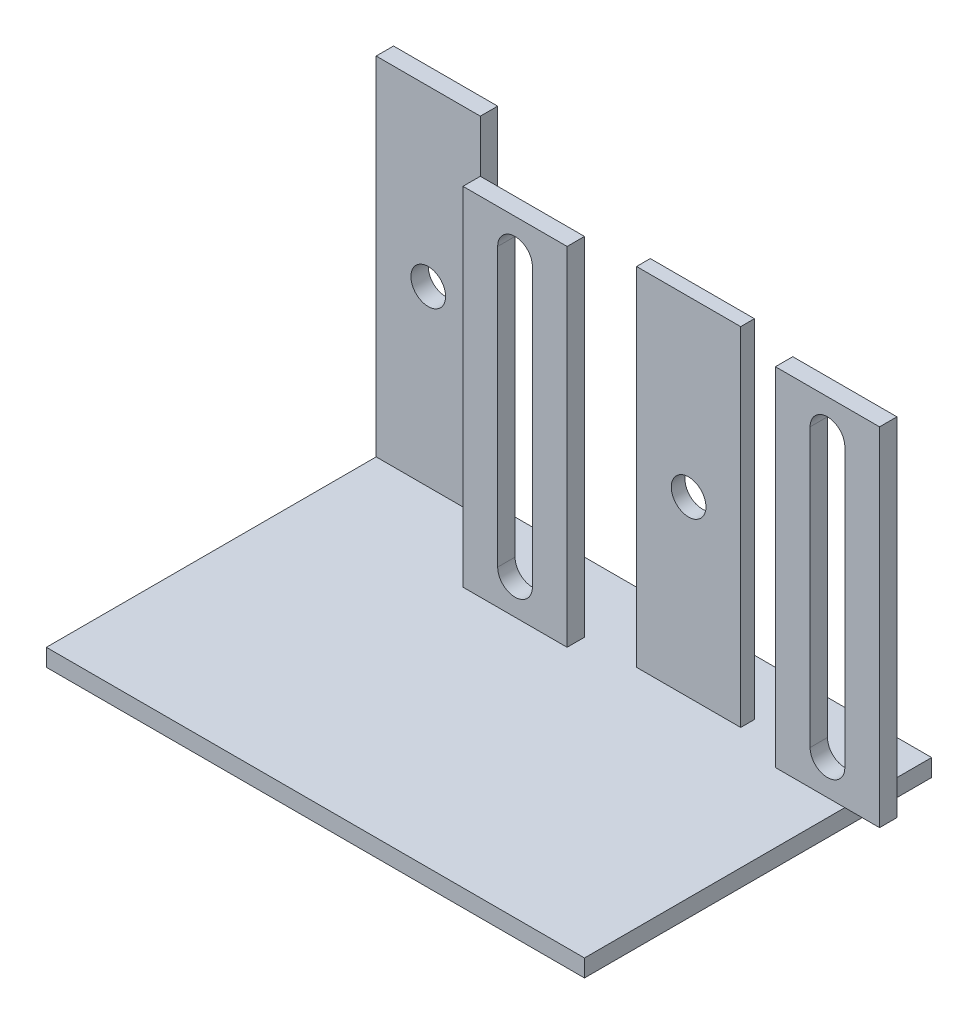
ISO-10303-21;
HEADER;
FILE_DESCRIPTION(('STEP AP214'),'2;1');
FILE_NAME('part.step','',(''),(''),'','','');
FILE_SCHEMA(('AUTOMOTIVE_DESIGN { 1 0 10303 214 1 1 1 1 }'));
ENDSEC;
DATA;
#1=APPLICATION_CONTEXT('core data for automotive mechanical design processes');
#2=APPLICATION_PROTOCOL_DEFINITION('international standard','automotive_design',2000,#1);
#3=PRODUCT_CONTEXT('',#1,'mechanical');
#4=PRODUCT('Part','Part','',(#3));
#5=PRODUCT_RELATED_PRODUCT_CATEGORY('part','',(#4));
#6=PRODUCT_DEFINITION_FORMATION('','',#4);
#7=PRODUCT_DEFINITION_CONTEXT('part definition',#1,'design');
#8=PRODUCT_DEFINITION('design','',#6,#7);
#9=PRODUCT_DEFINITION_SHAPE('','',#8);
#10=(LENGTH_UNIT() NAMED_UNIT(*) SI_UNIT(.MILLI.,.METRE.));
#11=(NAMED_UNIT(*) PLANE_ANGLE_UNIT() SI_UNIT($,.RADIAN.));
#12=(NAMED_UNIT(*) SI_UNIT($,.STERADIAN.) SOLID_ANGLE_UNIT());
#13=UNCERTAINTY_MEASURE_WITH_UNIT(LENGTH_MEASURE(1.E-05),#10,'distance_accuracy_value','');
#14=(GEOMETRIC_REPRESENTATION_CONTEXT(3) GLOBAL_UNCERTAINTY_ASSIGNED_CONTEXT((#13)) GLOBAL_UNIT_ASSIGNED_CONTEXT((#10,
#11,#12)) REPRESENTATION_CONTEXT('',''));
#15=CARTESIAN_POINT('',(0.,0.,0.));
#16=DIRECTION('',(0.,0.,1.));
#17=DIRECTION('',(1.,0.,0.));
#18=AXIS2_PLACEMENT_3D('',#15,#16,#17);
#19=CARTESIAN_POINT('',(0.,10.,0.));
#20=DIRECTION('',(0.,-1.,0.));
#21=DIRECTION('',(0.,0.,-1.));
#22=AXIS2_PLACEMENT_3D('',#19,#20,#21);
#23=PLANE('',#22);
#24=DIRECTION('',(1.,0.,0.));
#25=VECTOR('',#24,1.);
#26=CARTESIAN_POINT('',(270.,10.,-150.));
#27=LINE('',#26,#25);
#28=CARTESIAN_POINT('',(270.,10.,-150.));
#29=VERTEX_POINT('',#28);
#30=CARTESIAN_POINT('',(310.,10.,-150.));
#31=VERTEX_POINT('',#30);
#32=EDGE_CURVE('E371',#29,#31,#27,.T.);
#33=ORIENTED_EDGE('',*,*,#32,.F.);
#34=DIRECTION('',(0.,0.,1.));
#35=VECTOR('',#34,1.);
#36=CARTESIAN_POINT('',(270.,10.,-160.));
#37=LINE('',#36,#35);
#38=CARTESIAN_POINT('',(270.,10.,-160.));
#39=VERTEX_POINT('',#38);
#40=EDGE_CURVE('E375',#39,#29,#37,.T.);
#41=ORIENTED_EDGE('',*,*,#40,.F.);
#42=DIRECTION('',(-1.,0.,0.));
#43=VECTOR('',#42,1.);
#44=CARTESIAN_POINT('',(270.,10.,-160.));
#45=LINE('',#44,#43);
#46=CARTESIAN_POINT('',(310.,10.,-160.));
#47=VERTEX_POINT('',#46);
#48=EDGE_CURVE('E367',#47,#39,#45,.T.);
#49=ORIENTED_EDGE('',*,*,#48,.F.);
#50=DIRECTION('',(0.,0.,-1.));
#51=VECTOR('',#50,1.);
#52=CARTESIAN_POINT('',(310.,10.,0.));
#53=LINE('',#52,#51);
#54=CARTESIAN_POINT('',(310.,10.,-200.));
#55=VERTEX_POINT('',#54);
#56=EDGE_CURVE('E478',#47,#55,#53,.T.);
#57=ORIENTED_EDGE('',*,*,#56,.T.);
#58=DIRECTION('',(-1.,0.,0.));
#59=VECTOR('',#58,1.);
#60=CARTESIAN_POINT('',(0.,10.,-200.));
#61=LINE('',#60,#59);
#62=CARTESIAN_POINT('',(60.,10.,-200.));
#63=VERTEX_POINT('',#62);
#64=EDGE_CURVE('E483',#55,#63,#61,.T.);
#65=ORIENTED_EDGE('',*,*,#64,.T.);
#66=DIRECTION('',(0.,0.,-1.));
#67=VECTOR('',#66,1.);
#68=CARTESIAN_POINT('',(60.,10.,-200.));
#69=LINE('',#68,#67);
#70=CARTESIAN_POINT('',(60.,10.,-190.));
#71=VERTEX_POINT('',#70);
#72=EDGE_CURVE('E442',#71,#63,#69,.T.);
#73=ORIENTED_EDGE('',*,*,#72,.F.);
#74=DIRECTION('',(1.,0.,0.));
#75=VECTOR('',#74,1.);
#76=CARTESIAN_POINT('',(0.,10.,-190.));
#77=LINE('',#76,#75);
#78=CARTESIAN_POINT('',(0.,10.,-190.));
#79=VERTEX_POINT('',#78);
#80=EDGE_CURVE('E425',#79,#71,#77,.T.);
#81=ORIENTED_EDGE('',*,*,#80,.F.);
#82=DIRECTION('',(0.,0.,1.));
#83=VECTOR('',#82,1.);
#84=CARTESIAN_POINT('',(0.,10.,0.));
#85=LINE('',#84,#83);
#86=CARTESIAN_POINT('',(0.,10.,0.));
#87=VERTEX_POINT('',#86);
#88=EDGE_CURVE('E471',#79,#87,#85,.T.);
#89=ORIENTED_EDGE('',*,*,#88,.T.);
#90=DIRECTION('',(1.,0.,0.));
#91=VECTOR('',#90,1.);
#92=CARTESIAN_POINT('',(0.,10.,0.));
#93=LINE('',#92,#91);
#94=CARTESIAN_POINT('',(310.,10.,0.));
#95=VERTEX_POINT('',#94);
#96=EDGE_CURVE('E474',#87,#95,#93,.T.);
#97=ORIENTED_EDGE('',*,*,#96,.T.);
#98=EDGE_CURVE('E479',#95,#31,#53,.T.);
#99=ORIENTED_EDGE('',*,*,#98,.T.);
#100=EDGE_LOOP('',(#33,#41,#49,#57,#65,#73,#81,#89,#97,#99));
#101=FACE_BOUND('',#100,.T.);
#102=DIRECTION('',(0.,0.,1.));
#103=VECTOR('',#102,1.);
#104=CARTESIAN_POINT('',(90.,10.,-160.));
#105=LINE('',#104,#103);
#106=CARTESIAN_POINT('',(90.,10.,-160.));
#107=VERTEX_POINT('',#106);
#108=CARTESIAN_POINT('',(90.,10.,-150.));
#109=VERTEX_POINT('',#108);
#110=EDGE_CURVE('E421',#107,#109,#105,.T.);
#111=ORIENTED_EDGE('',*,*,#110,.F.);
#112=DIRECTION('',(-1.,0.,0.));
#113=VECTOR('',#112,1.);
#114=CARTESIAN_POINT('',(90.,10.,-160.));
#115=LINE('',#114,#113);
#116=CARTESIAN_POINT('',(150.,10.,-160.));
#117=VERTEX_POINT('',#116);
#118=EDGE_CURVE('E408',#117,#107,#115,.T.);
#119=ORIENTED_EDGE('',*,*,#118,.F.);
#120=DIRECTION('',(0.,0.,-1.));
#121=VECTOR('',#120,1.);
#122=CARTESIAN_POINT('',(150.,10.,-160.));
#123=LINE('',#122,#121);
#124=CARTESIAN_POINT('',(150.,10.,-150.));
#125=VERTEX_POINT('',#124);
#126=EDGE_CURVE('E412',#125,#117,#123,.T.);
#127=ORIENTED_EDGE('',*,*,#126,.F.);
#128=DIRECTION('',(1.,0.,0.));
#129=VECTOR('',#128,1.);
#130=CARTESIAN_POINT('',(90.,10.,-150.));
#131=LINE('',#130,#129);
#132=EDGE_CURVE('E417',#109,#125,#131,.T.);
#133=ORIENTED_EDGE('',*,*,#132,.F.);
#134=EDGE_LOOP('',(#111,#119,#127,#133));
#135=FACE_BOUND('',#134,.T.);
#136=DIRECTION('',(0.,0.,1.));
#137=VECTOR('',#136,1.);
#138=CARTESIAN_POINT('',(180.,10.,-160.));
#139=LINE('',#138,#137);
#140=CARTESIAN_POINT('',(180.,10.,-167.912912389238));
#141=VERTEX_POINT('',#140);
#142=CARTESIAN_POINT('',(180.,10.,-160.));
#143=VERTEX_POINT('',#142);
#144=EDGE_CURVE('E330',#141,#143,#139,.T.);
#145=ORIENTED_EDGE('',*,*,#144,.F.);
#146=DIRECTION('',(-1.,0.,0.));
#147=VECTOR('',#146,1.);
#148=CARTESIAN_POINT('',(180.,10.,-167.912912389238));
#149=LINE('',#148,#147);
#150=CARTESIAN_POINT('',(240.,10.,-167.912912389238));
#151=VERTEX_POINT('',#150);
#152=EDGE_CURVE('E317',#151,#141,#149,.T.);
#153=ORIENTED_EDGE('',*,*,#152,.F.);
#154=DIRECTION('',(0.,0.,-1.));
#155=VECTOR('',#154,1.);
#156=CARTESIAN_POINT('',(240.,10.,-160.));
#157=LINE('',#156,#155);
#158=CARTESIAN_POINT('',(240.,10.,-160.));
#159=VERTEX_POINT('',#158);
#160=EDGE_CURVE('E321',#159,#151,#157,.T.);
#161=ORIENTED_EDGE('',*,*,#160,.F.);
#162=DIRECTION('',(1.,0.,0.));
#163=VECTOR('',#162,1.);
#164=CARTESIAN_POINT('',(180.,10.,-160.));
#165=LINE('',#164,#163);
#166=EDGE_CURVE('E326',#143,#159,#165,.T.);
#167=ORIENTED_EDGE('',*,*,#166,.F.);
#168=EDGE_LOOP('',(#145,#153,#161,#167));
#169=FACE_BOUND('',#168,.T.);
#170=ADVANCED_FACE('F45',(#101,#135,#169),#23,.F.);
#171=CARTESIAN_POINT('',(0.,10.,0.));
#172=DIRECTION('',(1.,0.,0.));
#173=DIRECTION('',(0.,0.,-1.));
#174=AXIS2_PLACEMENT_3D('',#171,#172,#173);
#175=PLANE('',#174);
#176=DIRECTION('',(0.,0.,1.));
#177=VECTOR('',#176,1.);
#178=CARTESIAN_POINT('',(0.,0.,0.));
#179=LINE('',#178,#177);
#180=CARTESIAN_POINT('',(0.,0.,-200.));
#181=VERTEX_POINT('',#180);
#182=CARTESIAN_POINT('',(0.,0.,0.));
#183=VERTEX_POINT('',#182);
#184=EDGE_CURVE('E470',#181,#183,#179,.T.);
#185=ORIENTED_EDGE('',*,*,#184,.T.);
#186=DIRECTION('',(0.,-1.,0.));
#187=VECTOR('',#186,1.);
#188=CARTESIAN_POINT('',(0.,10.,0.));
#189=LINE('',#188,#187);
#190=EDGE_CURVE('E510',#87,#183,#189,.T.);
#191=ORIENTED_EDGE('',*,*,#190,.F.);
#192=ORIENTED_EDGE('',*,*,#88,.F.);
#193=DIRECTION('',(0.,-1.,0.));
#194=VECTOR('',#193,1.);
#195=CARTESIAN_POINT('',(0.,210.,-190.));
#196=LINE('',#195,#194);
#197=CARTESIAN_POINT('',(0.,210.,-190.));
#198=VERTEX_POINT('',#197);
#199=EDGE_CURVE('E466',#198,#79,#196,.T.);
#200=ORIENTED_EDGE('',*,*,#199,.F.);
#201=DIRECTION('',(0.,0.,1.));
#202=VECTOR('',#201,1.);
#203=CARTESIAN_POINT('',(0.,210.,-200.));
#204=LINE('',#203,#202);
#205=CARTESIAN_POINT('',(0.,210.,-200.));
#206=VERTEX_POINT('',#205);
#207=EDGE_CURVE('E437',#206,#198,#204,.T.);
#208=ORIENTED_EDGE('',*,*,#207,.F.);
#209=DIRECTION('',(0.,-1.,0.));
#210=VECTOR('',#209,1.);
#211=CARTESIAN_POINT('',(0.,10.,-200.));
#212=LINE('',#211,#210);
#213=EDGE_CURVE('E487',#206,#181,#212,.T.);
#214=ORIENTED_EDGE('',*,*,#213,.T.);
#215=EDGE_LOOP('',(#185,#191,#192,#200,#208,#214));
#216=FACE_BOUND('',#215,.T.);
#217=ADVANCED_FACE('F47',(#216),#175,.F.);
#218=CARTESIAN_POINT('',(0.,10.,0.));
#219=DIRECTION('',(0.,0.,-1.));
#220=DIRECTION('',(-1.,0.,0.));
#221=AXIS2_PLACEMENT_3D('',#218,#219,#220);
#222=PLANE('',#221);
#223=DIRECTION('',(1.,0.,0.));
#224=VECTOR('',#223,1.);
#225=CARTESIAN_POINT('',(0.,0.,0.));
#226=LINE('',#225,#224);
#227=CARTESIAN_POINT('',(310.,0.,0.));
#228=VERTEX_POINT('',#227);
#229=EDGE_CURVE('E491',#183,#228,#226,.T.);
#230=ORIENTED_EDGE('',*,*,#229,.T.);
#231=DIRECTION('',(0.,-1.,0.));
#232=VECTOR('',#231,1.);
#233=CARTESIAN_POINT('',(310.,10.,0.));
#234=LINE('',#233,#232);
#235=EDGE_CURVE('E506',#95,#228,#234,.T.);
#236=ORIENTED_EDGE('',*,*,#235,.F.);
#237=ORIENTED_EDGE('',*,*,#96,.F.);
#238=ORIENTED_EDGE('',*,*,#190,.T.);
#239=EDGE_LOOP('',(#230,#236,#237,#238));
#240=FACE_BOUND('',#239,.T.);
#241=ADVANCED_FACE('F569',(#240),#222,.F.);
#242=CARTESIAN_POINT('',(310.,10.,0.));
#243=DIRECTION('',(-1.,0.,0.));
#244=DIRECTION('',(0.,0.,1.));
#245=AXIS2_PLACEMENT_3D('',#242,#243,#244);
#246=PLANE('',#245);
#247=DIRECTION('',(0.,0.,-1.));
#248=VECTOR('',#247,1.);
#249=CARTESIAN_POINT('',(310.,0.,0.));
#250=LINE('',#249,#248);
#251=CARTESIAN_POINT('',(310.,0.,-200.));
#252=VERTEX_POINT('',#251);
#253=EDGE_CURVE('E494',#228,#252,#250,.T.);
#254=ORIENTED_EDGE('',*,*,#253,.T.);
#255=DIRECTION('',(0.,-1.,0.));
#256=VECTOR('',#255,1.);
#257=CARTESIAN_POINT('',(310.,10.,-200.));
#258=LINE('',#257,#256);
#259=EDGE_CURVE('E502',#55,#252,#258,.T.);
#260=ORIENTED_EDGE('',*,*,#259,.F.);
#261=ORIENTED_EDGE('',*,*,#56,.F.);
#262=EDGE_CURVE('E484',#31,#47,#53,.T.);
#263=ORIENTED_EDGE('',*,*,#262,.F.);
#264=ORIENTED_EDGE('',*,*,#98,.F.);
#265=ORIENTED_EDGE('',*,*,#235,.T.);
#266=EDGE_LOOP('',(#254,#260,#261,#263,#264,#265));
#267=FACE_BOUND('',#266,.T.);
#268=ADVANCED_FACE('F583',(#267),#246,.F.);
#269=CARTESIAN_POINT('',(0.,10.,-200.));
#270=DIRECTION('',(0.,0.,1.));
#271=DIRECTION('',(1.,0.,0.));
#272=AXIS2_PLACEMENT_3D('',#269,#270,#271);
#273=PLANE('',#272);
#274=CARTESIAN_POINT('',(30.,110.,-200.));
#275=DIRECTION('',(0.,0.,1.));
#276=DIRECTION('',(1.,0.,0.));
#277=AXIS2_PLACEMENT_3D('',#274,#275,#276);
#278=CIRCLE('',#277,10.);
#279=CARTESIAN_POINT('',(40.,110.,-200.));
#280=VERTEX_POINT('',#279);
#281=EDGE_CURVE('E296',#280,#280,#278,.T.);
#282=ORIENTED_EDGE('',*,*,#281,.T.);
#283=EDGE_LOOP('',(#282));
#284=FACE_BOUND('',#283,.T.);
#285=DIRECTION('',(-1.,0.,0.));
#286=VECTOR('',#285,1.);
#287=CARTESIAN_POINT('',(0.,0.,-200.));
#288=LINE('',#287,#286);
#289=EDGE_CURVE('E475',#252,#181,#288,.T.);
#290=ORIENTED_EDGE('',*,*,#289,.T.);
#291=ORIENTED_EDGE('',*,*,#213,.F.);
#292=DIRECTION('',(-1.,0.,0.));
#293=VECTOR('',#292,1.);
#294=CARTESIAN_POINT('',(0.,210.,-200.));
#295=LINE('',#294,#293);
#296=CARTESIAN_POINT('',(60.,210.,-200.));
#297=VERTEX_POINT('',#296);
#298=EDGE_CURVE('E448',#297,#206,#295,.T.);
#299=ORIENTED_EDGE('',*,*,#298,.F.);
#300=DIRECTION('',(0.,-1.,0.));
#301=VECTOR('',#300,1.);
#302=CARTESIAN_POINT('',(60.,210.,-200.));
#303=LINE('',#302,#301);
#304=EDGE_CURVE('E452',#297,#63,#303,.T.);
#305=ORIENTED_EDGE('',*,*,#304,.T.);
#306=ORIENTED_EDGE('',*,*,#64,.F.);
#307=ORIENTED_EDGE('',*,*,#259,.T.);
#308=EDGE_LOOP('',(#290,#291,#299,#305,#306,#307));
#309=FACE_BOUND('',#308,.T.);
#310=ADVANCED_FACE('F579',(#284,#309),#273,.F.);
#311=CARTESIAN_POINT('',(0.,0.,0.));
#312=DIRECTION('',(0.,-1.,0.));
#313=DIRECTION('',(0.,0.,-1.));
#314=AXIS2_PLACEMENT_3D('',#311,#312,#313);
#315=PLANE('',#314);
#316=ORIENTED_EDGE('',*,*,#184,.F.);
#317=ORIENTED_EDGE('',*,*,#289,.F.);
#318=ORIENTED_EDGE('',*,*,#253,.F.);
#319=ORIENTED_EDGE('',*,*,#229,.F.);
#320=EDGE_LOOP('',(#316,#317,#318,#319));
#321=FACE_BOUND('',#320,.T.);
#322=ADVANCED_FACE('F576',(#321),#315,.T.);
#323=CARTESIAN_POINT('',(0.,210.,-190.));
#324=DIRECTION('',(0.,0.,-1.));
#325=DIRECTION('',(-1.,0.,0.));
#326=AXIS2_PLACEMENT_3D('',#323,#324,#325);
#327=PLANE('',#326);
#328=CARTESIAN_POINT('',(30.,110.,-190.));
#329=DIRECTION('',(0.,0.,-1.));
#330=DIRECTION('',(-1.,0.,0.));
#331=AXIS2_PLACEMENT_3D('',#328,#329,#330);
#332=CIRCLE('',#331,10.);
#333=CARTESIAN_POINT('',(20.,110.,-190.));
#334=VERTEX_POINT('',#333);
#335=EDGE_CURVE('E49',#334,#334,#332,.T.);
#336=ORIENTED_EDGE('',*,*,#335,.T.);
#337=EDGE_LOOP('',(#336));
#338=FACE_BOUND('',#337,.T.);
#339=ORIENTED_EDGE('',*,*,#80,.T.);
#340=DIRECTION('',(0.,-1.,0.));
#341=VECTOR('',#340,1.);
#342=CARTESIAN_POINT('',(60.,210.,-190.));
#343=LINE('',#342,#341);
#344=CARTESIAN_POINT('',(60.,210.,-190.));
#345=VERTEX_POINT('',#344);
#346=EDGE_CURVE('E462',#345,#71,#343,.T.);
#347=ORIENTED_EDGE('',*,*,#346,.F.);
#348=DIRECTION('',(1.,0.,0.));
#349=VECTOR('',#348,1.);
#350=CARTESIAN_POINT('',(0.,210.,-190.));
#351=LINE('',#350,#349);
#352=EDGE_CURVE('E441',#198,#345,#351,.T.);
#353=ORIENTED_EDGE('',*,*,#352,.F.);
#354=ORIENTED_EDGE('',*,*,#199,.T.);
#355=EDGE_LOOP('',(#339,#347,#353,#354));
#356=FACE_BOUND('',#355,.T.);
#357=ADVANCED_FACE('F574',(#338,#356),#327,.F.);
#358=CARTESIAN_POINT('',(60.,210.,-200.));
#359=DIRECTION('',(-1.,0.,0.));
#360=DIRECTION('',(0.,0.,1.));
#361=AXIS2_PLACEMENT_3D('',#358,#359,#360);
#362=PLANE('',#361);
#363=ORIENTED_EDGE('',*,*,#72,.T.);
#364=ORIENTED_EDGE('',*,*,#304,.F.);
#365=DIRECTION('',(0.,0.,-1.));
#366=VECTOR('',#365,1.);
#367=CARTESIAN_POINT('',(60.,210.,-200.));
#368=LINE('',#367,#366);
#369=EDGE_CURVE('E445',#345,#297,#368,.T.);
#370=ORIENTED_EDGE('',*,*,#369,.F.);
#371=ORIENTED_EDGE('',*,*,#346,.T.);
#372=EDGE_LOOP('',(#363,#364,#370,#371));
#373=FACE_BOUND('',#372,.T.);
#374=ADVANCED_FACE('F611',(#373),#362,.F.);
#375=CARTESIAN_POINT('',(0.,210.,0.));
#376=DIRECTION('',(0.,1.,0.));
#377=DIRECTION('',(0.,0.,1.));
#378=AXIS2_PLACEMENT_3D('',#375,#376,#377);
#379=PLANE('',#378);
#380=ORIENTED_EDGE('',*,*,#207,.T.);
#381=ORIENTED_EDGE('',*,*,#352,.T.);
#382=ORIENTED_EDGE('',*,*,#369,.T.);
#383=ORIENTED_EDGE('',*,*,#298,.T.);
#384=EDGE_LOOP('',(#380,#381,#382,#383));
#385=FACE_BOUND('',#384,.T.);
#386=ADVANCED_FACE('F606',(#385),#379,.T.);
#387=CARTESIAN_POINT('',(90.,210.,-160.));
#388=DIRECTION('',(1.,0.,0.));
#389=DIRECTION('',(0.,0.,-1.));
#390=AXIS2_PLACEMENT_3D('',#387,#388,#389);
#391=PLANE('',#390);
#392=ORIENTED_EDGE('',*,*,#110,.T.);
#393=DIRECTION('',(0.,-1.,0.));
#394=VECTOR('',#393,1.);
#395=CARTESIAN_POINT('',(90.,210.,-150.));
#396=LINE('',#395,#394);
#397=CARTESIAN_POINT('',(90.,210.,-150.));
#398=VERTEX_POINT('',#397);
#399=EDGE_CURVE('E379',#398,#109,#396,.T.);
#400=ORIENTED_EDGE('',*,*,#399,.F.);
#401=DIRECTION('',(0.,0.,1.));
#402=VECTOR('',#401,1.);
#403=CARTESIAN_POINT('',(90.,210.,-160.));
#404=LINE('',#403,#402);
#405=CARTESIAN_POINT('',(90.,210.,-160.));
#406=VERTEX_POINT('',#405);
#407=EDGE_CURVE('E413',#406,#398,#404,.T.);
#408=ORIENTED_EDGE('',*,*,#407,.F.);
#409=DIRECTION('',(0.,-1.,0.));
#410=VECTOR('',#409,1.);
#411=CARTESIAN_POINT('',(90.,210.,-160.));
#412=LINE('',#411,#410);
#413=EDGE_CURVE('E403',#406,#107,#412,.T.);
#414=ORIENTED_EDGE('',*,*,#413,.T.);
#415=EDGE_LOOP('',(#392,#400,#408,#414));
#416=FACE_BOUND('',#415,.T.);
#417=ADVANCED_FACE('F664',(#416),#391,.F.);
#418=CARTESIAN_POINT('',(90.,210.,-150.));
#419=DIRECTION('',(0.,0.,-1.));
#420=DIRECTION('',(-1.,0.,0.));
#421=AXIS2_PLACEMENT_3D('',#418,#419,#420);
#422=PLANE('',#421);
#423=DIRECTION('',(0.,-1.,0.));
#424=VECTOR('',#423,1.);
#425=CARTESIAN_POINT('',(110.,190.,-150.));
#426=LINE('',#425,#424);
#427=CARTESIAN_POINT('',(110.,190.,-150.));
#428=VERTEX_POINT('',#427);
#429=CARTESIAN_POINT('',(110.,30.,-150.));
#430=VERTEX_POINT('',#429);
#431=EDGE_CURVE('E254',#428,#430,#426,.T.);
#432=ORIENTED_EDGE('',*,*,#431,.F.);
#433=CARTESIAN_POINT('',(120.,190.,-150.));
#434=DIRECTION('',(0.,0.,1.));
#435=DIRECTION('',(1.,0.,0.));
#436=AXIS2_PLACEMENT_3D('',#433,#434,#435);
#437=CIRCLE('',#436,10.);
#438=CARTESIAN_POINT('',(130.,190.,-150.));
#439=VERTEX_POINT('',#438);
#440=EDGE_CURVE('E62',#439,#428,#437,.T.);
#441=ORIENTED_EDGE('',*,*,#440,.F.);
#442=DIRECTION('',(0.,1.,0.));
#443=VECTOR('',#442,1.);
#444=CARTESIAN_POINT('',(130.,30.,-150.));
#445=LINE('',#444,#443);
#446=CARTESIAN_POINT('',(130.,30.,-150.));
#447=VERTEX_POINT('',#446);
#448=EDGE_CURVE('E241',#447,#439,#445,.T.);
#449=ORIENTED_EDGE('',*,*,#448,.F.);
#450=CARTESIAN_POINT('',(120.,30.,-150.));
#451=DIRECTION('',(0.,0.,1.));
#452=DIRECTION('',(1.,0.,0.));
#453=AXIS2_PLACEMENT_3D('',#450,#451,#452);
#454=CIRCLE('',#453,10.);
#455=EDGE_CURVE('E248',#430,#447,#454,.T.);
#456=ORIENTED_EDGE('',*,*,#455,.F.);
#457=EDGE_LOOP('',(#432,#441,#449,#456));
#458=FACE_BOUND('',#457,.T.);
#459=ORIENTED_EDGE('',*,*,#132,.T.);
#460=DIRECTION('',(0.,-1.,0.));
#461=VECTOR('',#460,1.);
#462=CARTESIAN_POINT('',(150.,210.,-150.));
#463=LINE('',#462,#461);
#464=CARTESIAN_POINT('',(150.,210.,-150.));
#465=VERTEX_POINT('',#464);
#466=EDGE_CURVE('E395',#465,#125,#463,.T.);
#467=ORIENTED_EDGE('',*,*,#466,.F.);
#468=DIRECTION('',(1.,0.,0.));
#469=VECTOR('',#468,1.);
#470=CARTESIAN_POINT('',(90.,210.,-150.));
#471=LINE('',#470,#469);
#472=EDGE_CURVE('E431',#398,#465,#471,.T.);
#473=ORIENTED_EDGE('',*,*,#472,.F.);
#474=ORIENTED_EDGE('',*,*,#399,.T.);
#475=EDGE_LOOP('',(#459,#467,#473,#474));
#476=FACE_BOUND('',#475,.T.);
#477=ADVANCED_FACE('F252',(#458,#476),#422,.F.);
#478=CARTESIAN_POINT('',(150.,210.,-160.));
#479=DIRECTION('',(-1.,0.,0.));
#480=DIRECTION('',(0.,0.,1.));
#481=AXIS2_PLACEMENT_3D('',#478,#479,#480);
#482=PLANE('',#481);
#483=ORIENTED_EDGE('',*,*,#126,.T.);
#484=DIRECTION('',(0.,-1.,0.));
#485=VECTOR('',#484,1.);
#486=CARTESIAN_POINT('',(150.,210.,-160.));
#487=LINE('',#486,#485);
#488=CARTESIAN_POINT('',(150.,210.,-160.));
#489=VERTEX_POINT('',#488);
#490=EDGE_CURVE('E399',#489,#117,#487,.T.);
#491=ORIENTED_EDGE('',*,*,#490,.F.);
#492=DIRECTION('',(0.,0.,-1.));
#493=VECTOR('',#492,1.);
#494=CARTESIAN_POINT('',(150.,210.,-160.));
#495=LINE('',#494,#493);
#496=EDGE_CURVE('E428',#465,#489,#495,.T.);
#497=ORIENTED_EDGE('',*,*,#496,.F.);
#498=ORIENTED_EDGE('',*,*,#466,.T.);
#499=EDGE_LOOP('',(#483,#491,#497,#498));
#500=FACE_BOUND('',#499,.T.);
#501=ADVANCED_FACE('F670',(#500),#482,.F.);
#502=CARTESIAN_POINT('',(90.,210.,-160.));
#503=DIRECTION('',(0.,0.,1.));
#504=DIRECTION('',(1.,0.,0.));
#505=AXIS2_PLACEMENT_3D('',#502,#503,#504);
#506=PLANE('',#505);
#507=DIRECTION('',(0.,1.,0.));
#508=VECTOR('',#507,1.);
#509=CARTESIAN_POINT('',(130.,210.,-160.));
#510=LINE('',#509,#508);
#511=CARTESIAN_POINT('',(130.,30.,-160.));
#512=VERTEX_POINT('',#511);
#513=CARTESIAN_POINT('',(130.,190.,-160.));
#514=VERTEX_POINT('',#513);
#515=EDGE_CURVE('E55',#512,#514,#510,.T.);
#516=ORIENTED_EDGE('',*,*,#515,.T.);
#517=CARTESIAN_POINT('',(120.,190.,-160.));
#518=DIRECTION('',(0.,0.,1.));
#519=DIRECTION('',(1.,0.,0.));
#520=AXIS2_PLACEMENT_3D('',#517,#518,#519);
#521=CIRCLE('',#520,10.);
#522=CARTESIAN_POINT('',(110.,190.,-160.));
#523=VERTEX_POINT('',#522);
#524=EDGE_CURVE('E11',#514,#523,#521,.T.);
#525=ORIENTED_EDGE('',*,*,#524,.T.);
#526=DIRECTION('',(0.,-1.,0.));
#527=VECTOR('',#526,1.);
#528=CARTESIAN_POINT('',(110.,210.,-160.));
#529=LINE('',#528,#527);
#530=CARTESIAN_POINT('',(110.,30.,-160.));
#531=VERTEX_POINT('',#530);
#532=EDGE_CURVE('E530',#523,#531,#529,.T.);
#533=ORIENTED_EDGE('',*,*,#532,.T.);
#534=CARTESIAN_POINT('',(120.,30.,-160.));
#535=DIRECTION('',(0.,0.,1.));
#536=DIRECTION('',(1.,0.,0.));
#537=AXIS2_PLACEMENT_3D('',#534,#535,#536);
#538=CIRCLE('',#537,10.);
#539=EDGE_CURVE('E534',#531,#512,#538,.T.);
#540=ORIENTED_EDGE('',*,*,#539,.T.);
#541=EDGE_LOOP('',(#516,#525,#533,#540));
#542=FACE_BOUND('',#541,.T.);
#543=ORIENTED_EDGE('',*,*,#118,.T.);
#544=ORIENTED_EDGE('',*,*,#413,.F.);
#545=DIRECTION('',(-1.,0.,0.));
#546=VECTOR('',#545,1.);
#547=CARTESIAN_POINT('',(90.,210.,-160.));
#548=LINE('',#547,#546);
#549=EDGE_CURVE('E407',#489,#406,#548,.T.);
#550=ORIENTED_EDGE('',*,*,#549,.F.);
#551=ORIENTED_EDGE('',*,*,#490,.T.);
#552=EDGE_LOOP('',(#543,#544,#550,#551));
#553=FACE_BOUND('',#552,.T.);
#554=ADVANCED_FACE('F540',(#542,#553),#506,.F.);
#555=CARTESIAN_POINT('',(0.,210.,0.));
#556=DIRECTION('',(0.,1.,0.));
#557=DIRECTION('',(0.,0.,1.));
#558=AXIS2_PLACEMENT_3D('',#555,#556,#557);
#559=PLANE('',#558);
#560=ORIENTED_EDGE('',*,*,#407,.T.);
#561=ORIENTED_EDGE('',*,*,#472,.T.);
#562=ORIENTED_EDGE('',*,*,#496,.T.);
#563=ORIENTED_EDGE('',*,*,#549,.T.);
#564=EDGE_LOOP('',(#560,#561,#562,#563));
#565=FACE_BOUND('',#564,.T.);
#566=ADVANCED_FACE('F676',(#565),#559,.T.);
#567=CARTESIAN_POINT('',(0.,10.,0.));
#568=DIRECTION('',(0.,1.,0.));
#569=DIRECTION('',(0.,0.,1.));
#570=AXIS2_PLACEMENT_3D('',#567,#568,#569);
#571=PLANE('',#570);
#572=CARTESIAN_POINT('',(330.,10.,-150.));
#573=VERTEX_POINT('',#572);
#574=EDGE_CURVE('E370',#31,#573,#27,.T.);
#575=ORIENTED_EDGE('',*,*,#574,.F.);
#576=ORIENTED_EDGE('',*,*,#262,.T.);
#577=CARTESIAN_POINT('',(330.,10.,-160.));
#578=VERTEX_POINT('',#577);
#579=EDGE_CURVE('E362',#578,#47,#45,.T.);
#580=ORIENTED_EDGE('',*,*,#579,.F.);
#581=DIRECTION('',(0.,0.,-1.));
#582=VECTOR('',#581,1.);
#583=CARTESIAN_POINT('',(330.,10.,-160.));
#584=LINE('',#583,#582);
#585=EDGE_CURVE('E366',#573,#578,#584,.T.);
#586=ORIENTED_EDGE('',*,*,#585,.F.);
#587=EDGE_LOOP('',(#575,#576,#580,#586));
#588=FACE_BOUND('',#587,.T.);
#589=ADVANCED_FACE('F630',(#588),#571,.F.);
#590=CARTESIAN_POINT('',(270.,210.,-160.));
#591=DIRECTION('',(1.,0.,0.));
#592=DIRECTION('',(0.,0.,-1.));
#593=AXIS2_PLACEMENT_3D('',#590,#591,#592);
#594=PLANE('',#593);
#595=ORIENTED_EDGE('',*,*,#40,.T.);
#596=DIRECTION('',(0.,-1.,0.));
#597=VECTOR('',#596,1.);
#598=CARTESIAN_POINT('',(270.,210.,-150.));
#599=LINE('',#598,#597);
#600=CARTESIAN_POINT('',(270.,210.,-150.));
#601=VERTEX_POINT('',#600);
#602=EDGE_CURVE('E334',#601,#29,#599,.T.);
#603=ORIENTED_EDGE('',*,*,#602,.F.);
#604=DIRECTION('',(0.,0.,1.));
#605=VECTOR('',#604,1.);
#606=CARTESIAN_POINT('',(270.,210.,-160.));
#607=LINE('',#606,#605);
#608=CARTESIAN_POINT('',(270.,210.,-160.));
#609=VERTEX_POINT('',#608);
#610=EDGE_CURVE('E388',#609,#601,#607,.T.);
#611=ORIENTED_EDGE('',*,*,#610,.F.);
#612=DIRECTION('',(0.,-1.,0.));
#613=VECTOR('',#612,1.);
#614=CARTESIAN_POINT('',(270.,210.,-160.));
#615=LINE('',#614,#613);
#616=EDGE_CURVE('E357',#609,#39,#615,.T.);
#617=ORIENTED_EDGE('',*,*,#616,.T.);
#618=EDGE_LOOP('',(#595,#603,#611,#617));
#619=FACE_BOUND('',#618,.T.);
#620=ADVANCED_FACE('F646',(#619),#594,.F.);
#621=CARTESIAN_POINT('',(270.,210.,-150.));
#622=DIRECTION('',(0.,0.,-1.));
#623=DIRECTION('',(-1.,0.,0.));
#624=AXIS2_PLACEMENT_3D('',#621,#622,#623);
#625=PLANE('',#624);
#626=DIRECTION('',(0.,-1.,0.));
#627=VECTOR('',#626,1.);
#628=CARTESIAN_POINT('',(290.,190.,-150.));
#629=LINE('',#628,#627);
#630=CARTESIAN_POINT('',(290.,190.,-150.));
#631=VERTEX_POINT('',#630);
#632=CARTESIAN_POINT('',(290.,30.,-150.));
#633=VERTEX_POINT('',#632);
#634=EDGE_CURVE('E287',#631,#633,#629,.T.);
#635=ORIENTED_EDGE('',*,*,#634,.F.);
#636=CARTESIAN_POINT('',(300.,190.,-150.));
#637=DIRECTION('',(0.,0.,1.));
#638=DIRECTION('',(1.,0.,0.));
#639=AXIS2_PLACEMENT_3D('',#636,#637,#638);
#640=CIRCLE('',#639,10.);
#641=CARTESIAN_POINT('',(310.,190.,-150.));
#642=VERTEX_POINT('',#641);
#643=EDGE_CURVE('E238',#642,#631,#640,.T.);
#644=ORIENTED_EDGE('',*,*,#643,.F.);
#645=DIRECTION('',(0.,1.,0.));
#646=VECTOR('',#645,1.);
#647=CARTESIAN_POINT('',(310.,30.,-150.));
#648=LINE('',#647,#646);
#649=CARTESIAN_POINT('',(310.,30.,-150.));
#650=VERTEX_POINT('',#649);
#651=EDGE_CURVE('E270',#650,#642,#648,.T.);
#652=ORIENTED_EDGE('',*,*,#651,.F.);
#653=CARTESIAN_POINT('',(300.,30.,-150.));
#654=DIRECTION('',(0.,0.,1.));
#655=DIRECTION('',(1.,0.,0.));
#656=AXIS2_PLACEMENT_3D('',#653,#654,#655);
#657=CIRCLE('',#656,10.);
#658=EDGE_CURVE('E283',#633,#650,#657,.T.);
#659=ORIENTED_EDGE('',*,*,#658,.F.);
#660=EDGE_LOOP('',(#635,#644,#652,#659));
#661=FACE_BOUND('',#660,.T.);
#662=ORIENTED_EDGE('',*,*,#32,.T.);
#663=ORIENTED_EDGE('',*,*,#574,.T.);
#664=DIRECTION('',(0.,-1.,0.));
#665=VECTOR('',#664,1.);
#666=CARTESIAN_POINT('',(330.,210.,-150.));
#667=LINE('',#666,#665);
#668=CARTESIAN_POINT('',(330.,210.,-150.));
#669=VERTEX_POINT('',#668);
#670=EDGE_CURVE('E349',#669,#573,#667,.T.);
#671=ORIENTED_EDGE('',*,*,#670,.F.);
#672=DIRECTION('',(1.,0.,0.));
#673=VECTOR('',#672,1.);
#674=CARTESIAN_POINT('',(270.,210.,-150.));
#675=LINE('',#674,#673);
#676=EDGE_CURVE('E385',#601,#669,#675,.T.);
#677=ORIENTED_EDGE('',*,*,#676,.F.);
#678=ORIENTED_EDGE('',*,*,#602,.T.);
#679=EDGE_LOOP('',(#662,#663,#671,#677,#678));
#680=FACE_BOUND('',#679,.T.);
#681=ADVANCED_FACE('F643',(#661,#680),#625,.F.);
#682=CARTESIAN_POINT('',(330.,210.,-160.));
#683=DIRECTION('',(-1.,0.,0.));
#684=DIRECTION('',(0.,0.,1.));
#685=AXIS2_PLACEMENT_3D('',#682,#683,#684);
#686=PLANE('',#685);
#687=ORIENTED_EDGE('',*,*,#585,.T.);
#688=DIRECTION('',(0.,-1.,0.));
#689=VECTOR('',#688,1.);
#690=CARTESIAN_POINT('',(330.,210.,-160.));
#691=LINE('',#690,#689);
#692=CARTESIAN_POINT('',(330.,210.,-160.));
#693=VERTEX_POINT('',#692);
#694=EDGE_CURVE('E353',#693,#578,#691,.T.);
#695=ORIENTED_EDGE('',*,*,#694,.F.);
#696=DIRECTION('',(0.,0.,-1.));
#697=VECTOR('',#696,1.);
#698=CARTESIAN_POINT('',(330.,210.,-160.));
#699=LINE('',#698,#697);
#700=EDGE_CURVE('E382',#669,#693,#699,.T.);
#701=ORIENTED_EDGE('',*,*,#700,.F.);
#702=ORIENTED_EDGE('',*,*,#670,.T.);
#703=EDGE_LOOP('',(#687,#695,#701,#702));
#704=FACE_BOUND('',#703,.T.);
#705=ADVANCED_FACE('F640',(#704),#686,.F.);
#706=CARTESIAN_POINT('',(270.,210.,-160.));
#707=DIRECTION('',(0.,0.,1.));
#708=DIRECTION('',(1.,0.,0.));
#709=AXIS2_PLACEMENT_3D('',#706,#707,#708);
#710=PLANE('',#709);
#711=DIRECTION('',(0.,1.,0.));
#712=VECTOR('',#711,1.);
#713=CARTESIAN_POINT('',(310.,210.,-160.));
#714=LINE('',#713,#712);
#715=CARTESIAN_POINT('',(310.,30.,-160.));
#716=VERTEX_POINT('',#715);
#717=CARTESIAN_POINT('',(310.,190.,-160.));
#718=VERTEX_POINT('',#717);
#719=EDGE_CURVE('E522',#716,#718,#714,.T.);
#720=ORIENTED_EDGE('',*,*,#719,.T.);
#721=CARTESIAN_POINT('',(300.,190.,-160.));
#722=DIRECTION('',(0.,0.,1.));
#723=DIRECTION('',(1.,0.,0.));
#724=AXIS2_PLACEMENT_3D('',#721,#722,#723);
#725=CIRCLE('',#724,10.);
#726=CARTESIAN_POINT('',(290.,190.,-160.));
#727=VERTEX_POINT('',#726);
#728=EDGE_CURVE('E526',#718,#727,#725,.T.);
#729=ORIENTED_EDGE('',*,*,#728,.T.);
#730=DIRECTION('',(0.,-1.,0.));
#731=VECTOR('',#730,1.);
#732=CARTESIAN_POINT('',(290.,210.,-160.));
#733=LINE('',#732,#731);
#734=CARTESIAN_POINT('',(290.,30.,-160.));
#735=VERTEX_POINT('',#734);
#736=EDGE_CURVE('E513',#727,#735,#733,.T.);
#737=ORIENTED_EDGE('',*,*,#736,.T.);
#738=CARTESIAN_POINT('',(300.,30.,-160.));
#739=DIRECTION('',(0.,0.,1.));
#740=DIRECTION('',(1.,0.,0.));
#741=AXIS2_PLACEMENT_3D('',#738,#739,#740);
#742=CIRCLE('',#741,10.);
#743=EDGE_CURVE('E518',#735,#716,#742,.T.);
#744=ORIENTED_EDGE('',*,*,#743,.T.);
#745=EDGE_LOOP('',(#720,#729,#737,#744));
#746=FACE_BOUND('',#745,.T.);
#747=ORIENTED_EDGE('',*,*,#579,.T.);
#748=ORIENTED_EDGE('',*,*,#48,.T.);
#749=ORIENTED_EDGE('',*,*,#616,.F.);
#750=DIRECTION('',(-1.,0.,0.));
#751=VECTOR('',#750,1.);
#752=CARTESIAN_POINT('',(270.,210.,-160.));
#753=LINE('',#752,#751);
#754=EDGE_CURVE('E361',#693,#609,#753,.T.);
#755=ORIENTED_EDGE('',*,*,#754,.F.);
#756=ORIENTED_EDGE('',*,*,#694,.T.);
#757=EDGE_LOOP('',(#747,#748,#749,#755,#756));
#758=FACE_BOUND('',#757,.T.);
#759=ADVANCED_FACE('F633',(#746,#758),#710,.F.);
#760=CARTESIAN_POINT('',(0.,210.,0.));
#761=DIRECTION('',(0.,1.,0.));
#762=DIRECTION('',(0.,0.,1.));
#763=AXIS2_PLACEMENT_3D('',#760,#761,#762);
#764=PLANE('',#763);
#765=ORIENTED_EDGE('',*,*,#610,.T.);
#766=ORIENTED_EDGE('',*,*,#676,.T.);
#767=ORIENTED_EDGE('',*,*,#700,.T.);
#768=ORIENTED_EDGE('',*,*,#754,.T.);
#769=EDGE_LOOP('',(#765,#766,#767,#768));
#770=FACE_BOUND('',#769,.T.);
#771=ADVANCED_FACE('F649',(#770),#764,.T.);
#772=CARTESIAN_POINT('',(180.,210.,-160.));
#773=DIRECTION('',(1.,0.,0.));
#774=DIRECTION('',(0.,0.,-1.));
#775=AXIS2_PLACEMENT_3D('',#772,#773,#774);
#776=PLANE('',#775);
#777=ORIENTED_EDGE('',*,*,#144,.T.);
#778=DIRECTION('',(0.,-1.,0.));
#779=VECTOR('',#778,1.);
#780=CARTESIAN_POINT('',(180.,210.,-160.));
#781=LINE('',#780,#779);
#782=CARTESIAN_POINT('',(180.,210.,-160.));
#783=VERTEX_POINT('',#782);
#784=EDGE_CURVE('E300',#783,#143,#781,.T.);
#785=ORIENTED_EDGE('',*,*,#784,.F.);
#786=DIRECTION('',(0.,0.,1.));
#787=VECTOR('',#786,1.);
#788=CARTESIAN_POINT('',(180.,210.,-160.));
#789=LINE('',#788,#787);
#790=CARTESIAN_POINT('',(180.,210.,-167.912912389238));
#791=VERTEX_POINT('',#790);
#792=EDGE_CURVE('E322',#791,#783,#789,.T.);
#793=ORIENTED_EDGE('',*,*,#792,.F.);
#794=DIRECTION('',(0.,-1.,0.));
#795=VECTOR('',#794,1.);
#796=CARTESIAN_POINT('',(180.,210.,-167.912912389238));
#797=LINE('',#796,#795);
#798=EDGE_CURVE('E312',#791,#141,#797,.T.);
#799=ORIENTED_EDGE('',*,*,#798,.T.);
#800=EDGE_LOOP('',(#777,#785,#793,#799));
#801=FACE_BOUND('',#800,.T.);
#802=ADVANCED_FACE('F651',(#801),#776,.F.);
#803=CARTESIAN_POINT('',(180.,210.,-160.));
#804=DIRECTION('',(0.,0.,-1.));
#805=DIRECTION('',(-1.,0.,0.));
#806=AXIS2_PLACEMENT_3D('',#803,#804,#805);
#807=PLANE('',#806);
#808=CARTESIAN_POINT('',(210.,110.,-160.));
#809=DIRECTION('',(0.,0.,-1.));
#810=DIRECTION('',(-1.,0.,0.));
#811=AXIS2_PLACEMENT_3D('',#808,#809,#810);
#812=CIRCLE('',#811,10.);
#813=CARTESIAN_POINT('',(200.,110.,-160.));
#814=VERTEX_POINT('',#813);
#815=EDGE_CURVE('E261',#814,#814,#812,.T.);
#816=ORIENTED_EDGE('',*,*,#815,.T.);
#817=EDGE_LOOP('',(#816));
#818=FACE_BOUND('',#817,.T.);
#819=ORIENTED_EDGE('',*,*,#166,.T.);
#820=DIRECTION('',(0.,-1.,0.));
#821=VECTOR('',#820,1.);
#822=CARTESIAN_POINT('',(240.,210.,-160.));
#823=LINE('',#822,#821);
#824=CARTESIAN_POINT('',(240.,210.,-160.));
#825=VERTEX_POINT('',#824);
#826=EDGE_CURVE('E304',#825,#159,#823,.T.);
#827=ORIENTED_EDGE('',*,*,#826,.F.);
#828=DIRECTION('',(1.,0.,0.));
#829=VECTOR('',#828,1.);
#830=CARTESIAN_POINT('',(180.,210.,-160.));
#831=LINE('',#830,#829);
#832=EDGE_CURVE('E340',#783,#825,#831,.T.);
#833=ORIENTED_EDGE('',*,*,#832,.F.);
#834=ORIENTED_EDGE('',*,*,#784,.T.);
#835=EDGE_LOOP('',(#819,#827,#833,#834));
#836=FACE_BOUND('',#835,.T.);
#837=ADVANCED_FACE('F657',(#818,#836),#807,.F.);
#838=CARTESIAN_POINT('',(240.,210.,-160.));
#839=DIRECTION('',(-1.,0.,0.));
#840=DIRECTION('',(0.,0.,1.));
#841=AXIS2_PLACEMENT_3D('',#838,#839,#840);
#842=PLANE('',#841);
#843=ORIENTED_EDGE('',*,*,#160,.T.);
#844=DIRECTION('',(0.,-1.,0.));
#845=VECTOR('',#844,1.);
#846=CARTESIAN_POINT('',(240.,210.,-167.912912389238));
#847=LINE('',#846,#845);
#848=CARTESIAN_POINT('',(240.,210.,-167.912912389238));
#849=VERTEX_POINT('',#848);
#850=EDGE_CURVE('E308',#849,#151,#847,.T.);
#851=ORIENTED_EDGE('',*,*,#850,.F.);
#852=DIRECTION('',(0.,0.,-1.));
#853=VECTOR('',#852,1.);
#854=CARTESIAN_POINT('',(240.,210.,-160.));
#855=LINE('',#854,#853);
#856=EDGE_CURVE('E337',#825,#849,#855,.T.);
#857=ORIENTED_EDGE('',*,*,#856,.F.);
#858=ORIENTED_EDGE('',*,*,#826,.T.);
#859=EDGE_LOOP('',(#843,#851,#857,#858));
#860=FACE_BOUND('',#859,.T.);
#861=ADVANCED_FACE('F744',(#860),#842,.F.);
#862=CARTESIAN_POINT('',(180.,210.,-167.912912389238));
#863=DIRECTION('',(0.,0.,1.));
#864=DIRECTION('',(1.,0.,0.));
#865=AXIS2_PLACEMENT_3D('',#862,#863,#864);
#866=PLANE('',#865);
#867=CARTESIAN_POINT('',(210.,110.,-167.912912389238));
#868=DIRECTION('',(0.,0.,1.));
#869=DIRECTION('',(1.,0.,0.));
#870=AXIS2_PLACEMENT_3D('',#867,#868,#869);
#871=CIRCLE('',#870,10.);
#872=CARTESIAN_POINT('',(220.,110.,-167.912912389238));
#873=VERTEX_POINT('',#872);
#874=EDGE_CURVE('E256',#873,#873,#871,.T.);
#875=ORIENTED_EDGE('',*,*,#874,.T.);
#876=EDGE_LOOP('',(#875));
#877=FACE_BOUND('',#876,.T.);
#878=ORIENTED_EDGE('',*,*,#152,.T.);
#879=ORIENTED_EDGE('',*,*,#798,.F.);
#880=DIRECTION('',(-1.,0.,0.));
#881=VECTOR('',#880,1.);
#882=CARTESIAN_POINT('',(180.,210.,-167.912912389238));
#883=LINE('',#882,#881);
#884=EDGE_CURVE('E316',#849,#791,#883,.T.);
#885=ORIENTED_EDGE('',*,*,#884,.F.);
#886=ORIENTED_EDGE('',*,*,#850,.T.);
#887=EDGE_LOOP('',(#878,#879,#885,#886));
#888=FACE_BOUND('',#887,.T.);
#889=ADVANCED_FACE('F754',(#877,#888),#866,.F.);
#890=CARTESIAN_POINT('',(0.,210.,0.));
#891=DIRECTION('',(0.,-1.,0.));
#892=DIRECTION('',(0.,0.,-1.));
#893=AXIS2_PLACEMENT_3D('',#890,#891,#892);
#894=PLANE('',#893);
#895=ORIENTED_EDGE('',*,*,#792,.T.);
#896=ORIENTED_EDGE('',*,*,#832,.T.);
#897=ORIENTED_EDGE('',*,*,#856,.T.);
#898=ORIENTED_EDGE('',*,*,#884,.T.);
#899=EDGE_LOOP('',(#895,#896,#897,#898));
#900=FACE_BOUND('',#899,.T.);
#901=ADVANCED_FACE('F759',(#900),#894,.F.);
#902=CARTESIAN_POINT('',(210.,110.,-350.));
#903=DIRECTION('',(0.,0.,1.));
#904=DIRECTION('',(1.,0.,0.));
#905=AXIS2_PLACEMENT_3D('',#902,#903,#904);
#906=CYLINDRICAL_SURFACE('',#905,10.);
#907=ORIENTED_EDGE('',*,*,#874,.F.);
#908=EDGE_LOOP('',(#907));
#909=FACE_BOUND('',#908,.T.);
#910=ORIENTED_EDGE('',*,*,#815,.F.);
#911=EDGE_LOOP('',(#910));
#912=FACE_BOUND('',#911,.T.);
#913=ADVANCED_FACE('F768',(#909,#912),#906,.F.);
#914=CARTESIAN_POINT('',(300.,190.,-350.));
#915=DIRECTION('',(0.,0.,1.));
#916=DIRECTION('',(1.,0.,0.));
#917=AXIS2_PLACEMENT_3D('',#914,#915,#916);
#918=CYLINDRICAL_SURFACE('',#917,10.);
#919=DIRECTION('',(0.,0.,1.));
#920=VECTOR('',#919,1.);
#921=CARTESIAN_POINT('',(310.,190.,-350.));
#922=LINE('',#921,#920);
#923=EDGE_CURVE('E277',#718,#642,#922,.T.);
#924=ORIENTED_EDGE('',*,*,#923,.T.);
#925=ORIENTED_EDGE('',*,*,#643,.T.);
#926=DIRECTION('',(0.,0.,1.));
#927=VECTOR('',#926,1.);
#928=CARTESIAN_POINT('',(290.,190.,-350.));
#929=LINE('',#928,#927);
#930=EDGE_CURVE('E266',#727,#631,#929,.T.);
#931=ORIENTED_EDGE('',*,*,#930,.F.);
#932=ORIENTED_EDGE('',*,*,#728,.F.);
#933=EDGE_LOOP('',(#924,#925,#931,#932));
#934=FACE_BOUND('',#933,.T.);
#935=ADVANCED_FACE('F773',(#934),#918,.F.);
#936=CARTESIAN_POINT('',(310.,30.,-350.));
#937=DIRECTION('',(1.,0.,0.));
#938=DIRECTION('',(0.,0.,-1.));
#939=AXIS2_PLACEMENT_3D('',#936,#937,#938);
#940=PLANE('',#939);
#941=DIRECTION('',(0.,0.,1.));
#942=VECTOR('',#941,1.);
#943=CARTESIAN_POINT('',(310.,30.,-350.));
#944=LINE('',#943,#942);
#945=EDGE_CURVE('E274',#716,#650,#944,.T.);
#946=ORIENTED_EDGE('',*,*,#945,.T.);
#947=ORIENTED_EDGE('',*,*,#651,.T.);
#948=ORIENTED_EDGE('',*,*,#923,.F.);
#949=ORIENTED_EDGE('',*,*,#719,.F.);
#950=EDGE_LOOP('',(#946,#947,#948,#949));
#951=FACE_BOUND('',#950,.T.);
#952=ADVANCED_FACE('F784',(#951),#940,.F.);
#953=CARTESIAN_POINT('',(300.,30.,-350.));
#954=DIRECTION('',(0.,0.,1.));
#955=DIRECTION('',(1.,0.,0.));
#956=AXIS2_PLACEMENT_3D('',#953,#954,#955);
#957=CYLINDRICAL_SURFACE('',#956,10.);
#958=DIRECTION('',(0.,0.,1.));
#959=VECTOR('',#958,1.);
#960=CARTESIAN_POINT('',(290.,30.,-350.));
#961=LINE('',#960,#959);
#962=EDGE_CURVE('E271',#735,#633,#961,.T.);
#963=ORIENTED_EDGE('',*,*,#962,.T.);
#964=ORIENTED_EDGE('',*,*,#658,.T.);
#965=ORIENTED_EDGE('',*,*,#945,.F.);
#966=ORIENTED_EDGE('',*,*,#743,.F.);
#967=EDGE_LOOP('',(#963,#964,#965,#966));
#968=FACE_BOUND('',#967,.T.);
#969=ADVANCED_FACE('F795',(#968),#957,.F.);
#970=CARTESIAN_POINT('',(290.,190.,-350.));
#971=DIRECTION('',(-1.,0.,0.));
#972=DIRECTION('',(0.,0.,1.));
#973=AXIS2_PLACEMENT_3D('',#970,#971,#972);
#974=PLANE('',#973);
#975=ORIENTED_EDGE('',*,*,#930,.T.);
#976=ORIENTED_EDGE('',*,*,#634,.T.);
#977=ORIENTED_EDGE('',*,*,#962,.F.);
#978=ORIENTED_EDGE('',*,*,#736,.F.);
#979=EDGE_LOOP('',(#975,#976,#977,#978));
#980=FACE_BOUND('',#979,.T.);
#981=ADVANCED_FACE('F806',(#980),#974,.F.);
#982=CARTESIAN_POINT('',(120.,190.,-350.));
#983=DIRECTION('',(0.,0.,1.));
#984=DIRECTION('',(1.,0.,0.));
#985=AXIS2_PLACEMENT_3D('',#982,#983,#984);
#986=CYLINDRICAL_SURFACE('',#985,10.);
#987=DIRECTION('',(0.,0.,1.));
#988=VECTOR('',#987,1.);
#989=CARTESIAN_POINT('',(130.,190.,-350.));
#990=LINE('',#989,#988);
#991=EDGE_CURVE('E231',#514,#439,#990,.T.);
#992=ORIENTED_EDGE('',*,*,#991,.T.);
#993=ORIENTED_EDGE('',*,*,#440,.T.);
#994=DIRECTION('',(0.,0.,1.));
#995=VECTOR('',#994,1.);
#996=CARTESIAN_POINT('',(110.,190.,-350.));
#997=LINE('',#996,#995);
#998=EDGE_CURVE('E249',#523,#428,#997,.T.);
#999=ORIENTED_EDGE('',*,*,#998,.F.);
#1000=ORIENTED_EDGE('',*,*,#524,.F.);
#1001=EDGE_LOOP('',(#992,#993,#999,#1000));
#1002=FACE_BOUND('',#1001,.T.);
#1003=ADVANCED_FACE('F233',(#1002),#986,.F.);
#1004=CARTESIAN_POINT('',(130.,30.,-350.));
#1005=DIRECTION('',(1.,0.,0.));
#1006=DIRECTION('',(0.,1.,0.));
#1007=AXIS2_PLACEMENT_3D('',#1004,#1005,#1006);
#1008=PLANE('',#1007);
#1009=DIRECTION('',(0.,0.,1.));
#1010=VECTOR('',#1009,1.);
#1011=CARTESIAN_POINT('',(130.,30.,-350.));
#1012=LINE('',#1011,#1010);
#1013=EDGE_CURVE('E237',#512,#447,#1012,.T.);
#1014=ORIENTED_EDGE('',*,*,#1013,.T.);
#1015=ORIENTED_EDGE('',*,*,#448,.T.);
#1016=ORIENTED_EDGE('',*,*,#991,.F.);
#1017=ORIENTED_EDGE('',*,*,#515,.F.);
#1018=EDGE_LOOP('',(#1014,#1015,#1016,#1017));
#1019=FACE_BOUND('',#1018,.T.);
#1020=ADVANCED_FACE('F242',(#1019),#1008,.F.);
#1021=CARTESIAN_POINT('',(120.,30.,-350.));
#1022=DIRECTION('',(0.,0.,1.));
#1023=DIRECTION('',(1.,0.,0.));
#1024=AXIS2_PLACEMENT_3D('',#1021,#1022,#1023);
#1025=CYLINDRICAL_SURFACE('',#1024,10.);
#1026=DIRECTION('',(0.,0.,1.));
#1027=VECTOR('',#1026,1.);
#1028=CARTESIAN_POINT('',(110.,30.,-350.));
#1029=LINE('',#1028,#1027);
#1030=EDGE_CURVE('E70',#531,#430,#1029,.T.);
#1031=ORIENTED_EDGE('',*,*,#1030,.T.);
#1032=ORIENTED_EDGE('',*,*,#455,.T.);
#1033=ORIENTED_EDGE('',*,*,#1013,.F.);
#1034=ORIENTED_EDGE('',*,*,#539,.F.);
#1035=EDGE_LOOP('',(#1031,#1032,#1033,#1034));
#1036=FACE_BOUND('',#1035,.T.);
#1037=ADVANCED_FACE('F543',(#1036),#1025,.F.);
#1038=CARTESIAN_POINT('',(110.,190.,-350.));
#1039=DIRECTION('',(-1.,0.,0.));
#1040=DIRECTION('',(0.,-1.,0.));
#1041=AXIS2_PLACEMENT_3D('',#1038,#1039,#1040);
#1042=PLANE('',#1041);
#1043=ORIENTED_EDGE('',*,*,#998,.T.);
#1044=ORIENTED_EDGE('',*,*,#431,.T.);
#1045=ORIENTED_EDGE('',*,*,#1030,.F.);
#1046=ORIENTED_EDGE('',*,*,#532,.F.);
#1047=EDGE_LOOP('',(#1043,#1044,#1045,#1046));
#1048=FACE_BOUND('',#1047,.T.);
#1049=ADVANCED_FACE('F551',(#1048),#1042,.F.);
#1050=CARTESIAN_POINT('',(30.,110.,-350.));
#1051=DIRECTION('',(0.,0.,1.));
#1052=DIRECTION('',(1.,0.,0.));
#1053=AXIS2_PLACEMENT_3D('',#1050,#1051,#1052);
#1054=CYLINDRICAL_SURFACE('',#1053,10.);
#1055=ORIENTED_EDGE('',*,*,#335,.F.);
#1056=EDGE_LOOP('',(#1055));
#1057=FACE_BOUND('',#1056,.T.);
#1058=ORIENTED_EDGE('',*,*,#281,.F.);
#1059=EDGE_LOOP('',(#1058));
#1060=FACE_BOUND('',#1059,.T.);
#1061=ADVANCED_FACE('F553',(#1057,#1060),#1054,.F.);
#1062=CLOSED_SHELL('',(#170,#217,#241,#268,#310,#322,#357,#374,#386,#417,#477,#501,#554,#566,
#589,#620,#681,#705,#759,#771,#802,#837,#861,#889,#901,#913,#935,#952,#969,#981,#1003,#1020,
#1037,#1049,#1061));
#1063=MANIFOLD_SOLID_BREP('B2',#1062);
#1064=ADVANCED_BREP_SHAPE_REPRESENTATION('',(#18,#1063),#14);
#1065=SHAPE_DEFINITION_REPRESENTATION(#9,#1064);
ENDSEC;
END-ISO-10303-21;
